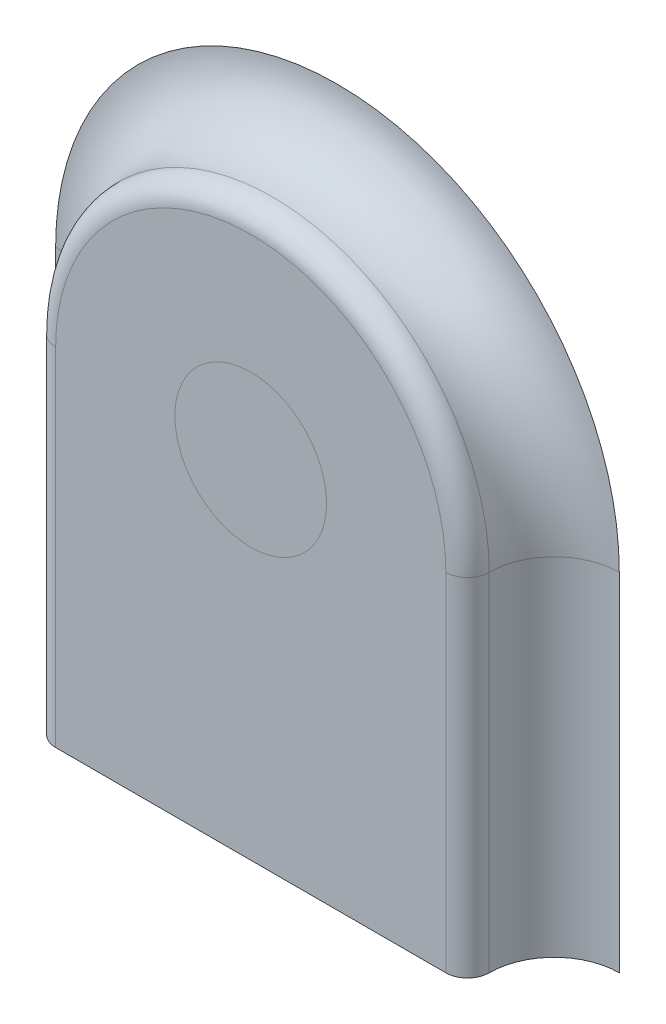
ISO-10303-21;
HEADER;
FILE_DESCRIPTION(('STEP AP214'),'2;1');
FILE_NAME('part.step','',(''),(''),'','','');
FILE_SCHEMA(('AUTOMOTIVE_DESIGN { 1 0 10303 214 1 1 1 1 }'));
ENDSEC;
DATA;
#1=APPLICATION_CONTEXT('core data for automotive mechanical design processes');
#2=APPLICATION_PROTOCOL_DEFINITION('international standard','automotive_design',2000,#1);
#3=PRODUCT_CONTEXT('',#1,'mechanical');
#4=PRODUCT('Part','Part','',(#3));
#5=PRODUCT_RELATED_PRODUCT_CATEGORY('part','',(#4));
#6=PRODUCT_DEFINITION_FORMATION('','',#4);
#7=PRODUCT_DEFINITION_CONTEXT('part definition',#1,'design');
#8=PRODUCT_DEFINITION('design','',#6,#7);
#9=PRODUCT_DEFINITION_SHAPE('','',#8);
#10=(LENGTH_UNIT() NAMED_UNIT(*) SI_UNIT(.MILLI.,.METRE.));
#11=(NAMED_UNIT(*) PLANE_ANGLE_UNIT() SI_UNIT($,.RADIAN.));
#12=(NAMED_UNIT(*) SI_UNIT($,.STERADIAN.) SOLID_ANGLE_UNIT());
#13=UNCERTAINTY_MEASURE_WITH_UNIT(LENGTH_MEASURE(1.E-05),#10,'distance_accuracy_value','');
#14=(GEOMETRIC_REPRESENTATION_CONTEXT(3) GLOBAL_UNCERTAINTY_ASSIGNED_CONTEXT((#13)) GLOBAL_UNIT_ASSIGNED_CONTEXT((#10,
#11,#12)) REPRESENTATION_CONTEXT('',''));
#15=CARTESIAN_POINT('',(0.,0.,0.));
#16=DIRECTION('',(0.,0.,1.));
#17=DIRECTION('',(1.,0.,0.));
#18=AXIS2_PLACEMENT_3D('',#15,#16,#17);
#19=CARTESIAN_POINT('',(0.,0.,2.));
#20=DIRECTION('',(0.,0.,1.));
#21=DIRECTION('',(1.,0.,0.));
#22=AXIS2_PLACEMENT_3D('',#19,#20,#21);
#23=PLANE('',#22);
#24=DIRECTION('',(1.,0.,0.));
#25=VECTOR('',#24,1.);
#26=CARTESIAN_POINT('',(-5.,-8.,2.));
#27=LINE('',#26,#25);
#28=CARTESIAN_POINT('',(-4.5,-8.,2.));
#29=VERTEX_POINT('',#28);
#30=CARTESIAN_POINT('',(4.5,-8.,2.));
#31=VERTEX_POINT('',#30);
#32=EDGE_CURVE('E112',#29,#31,#27,.T.);
#33=ORIENTED_EDGE('',*,*,#32,.T.);
#34=DIRECTION('',(0.,1.,0.));
#35=VECTOR('',#34,1.);
#36=CARTESIAN_POINT('',(4.5,0.,2.));
#37=LINE('',#36,#35);
#38=CARTESIAN_POINT('',(4.5,0.,2.));
#39=VERTEX_POINT('',#38);
#40=EDGE_CURVE('E133',#31,#39,#37,.T.);
#41=ORIENTED_EDGE('',*,*,#40,.T.);
#42=CARTESIAN_POINT('',(0.,0.,2.));
#43=DIRECTION('',(0.,0.,1.));
#44=DIRECTION('',(1.,0.,0.));
#45=AXIS2_PLACEMENT_3D('',#42,#43,#44);
#46=CIRCLE('',#45,4.5);
#47=CARTESIAN_POINT('',(-4.5,0.,2.));
#48=VERTEX_POINT('',#47);
#49=EDGE_CURVE('E54',#39,#48,#46,.T.);
#50=ORIENTED_EDGE('',*,*,#49,.T.);
#51=DIRECTION('',(0.,-1.,0.));
#52=VECTOR('',#51,1.);
#53=CARTESIAN_POINT('',(-4.5,-8.,2.));
#54=LINE('',#53,#52);
#55=EDGE_CURVE('E131',#48,#29,#54,.T.);
#56=ORIENTED_EDGE('',*,*,#55,.T.);
#57=EDGE_LOOP('',(#33,#41,#50,#56));
#58=FACE_BOUND('',#57,.T.);
#59=CARTESIAN_POINT('',(0.,0.,2.));
#60=DIRECTION('',(0.,0.,1.));
#61=DIRECTION('',(1.,0.,0.));
#62=AXIS2_PLACEMENT_3D('',#59,#60,#61);
#63=CIRCLE('',#62,1.75);
#64=CARTESIAN_POINT('',(1.75,0.,2.));
#65=VERTEX_POINT('',#64);
#66=EDGE_CURVE('E11',#65,#65,#63,.F.);
#67=ORIENTED_EDGE('',*,*,#66,.T.);
#68=EDGE_LOOP('',(#67));
#69=FACE_BOUND('',#68,.T.);
#70=ADVANCED_FACE('F38',(#58,#69),#23,.T.);
#71=CARTESIAN_POINT('',(-5.,-8.,2.));
#72=DIRECTION('',(0.,1.,0.));
#73=DIRECTION('',(0.,0.,1.));
#74=AXIS2_PLACEMENT_3D('',#71,#72,#73);
#75=PLANE('',#74);
#76=CARTESIAN_POINT('',(6.5,-8.,1.5));
#77=DIRECTION('',(0.,1.,0.));
#78=DIRECTION('',(0.,0.,1.));
#79=AXIS2_PLACEMENT_3D('',#76,#77,#78);
#80=CIRCLE('',#79,1.5);
#81=CARTESIAN_POINT('',(6.5,-8.,0.));
#82=VERTEX_POINT('',#81);
#83=CARTESIAN_POINT('',(5.,-8.,1.5));
#84=VERTEX_POINT('',#83);
#85=EDGE_CURVE('E107',#82,#84,#80,.T.);
#86=ORIENTED_EDGE('',*,*,#85,.T.);
#87=CARTESIAN_POINT('',(4.5,-8.,1.5));
#88=DIRECTION('',(0.,1.,0.));
#89=DIRECTION('',(0.,0.,1.));
#90=AXIS2_PLACEMENT_3D('',#87,#88,#89);
#91=CIRCLE('',#90,0.5);
#92=EDGE_CURVE('E47',#84,#31,#91,.F.);
#93=ORIENTED_EDGE('',*,*,#92,.T.);
#94=ORIENTED_EDGE('',*,*,#32,.F.);
#95=CARTESIAN_POINT('',(-4.5,-8.,1.5));
#96=DIRECTION('',(0.,1.,0.));
#97=DIRECTION('',(0.,0.,1.));
#98=AXIS2_PLACEMENT_3D('',#95,#96,#97);
#99=CIRCLE('',#98,0.5);
#100=CARTESIAN_POINT('',(-5.,-8.,1.5));
#101=VERTEX_POINT('',#100);
#102=EDGE_CURVE('E135',#29,#101,#99,.F.);
#103=ORIENTED_EDGE('',*,*,#102,.T.);
#104=CARTESIAN_POINT('',(-6.5,-8.,1.5));
#105=DIRECTION('',(0.,1.,0.));
#106=DIRECTION('',(0.,0.,1.));
#107=AXIS2_PLACEMENT_3D('',#104,#105,#106);
#108=CIRCLE('',#107,1.5);
#109=CARTESIAN_POINT('',(-6.5,-8.,0.));
#110=VERTEX_POINT('',#109);
#111=EDGE_CURVE('E110',#101,#110,#108,.T.);
#112=ORIENTED_EDGE('',*,*,#111,.T.);
#113=DIRECTION('',(1.,0.,0.));
#114=VECTOR('',#113,1.);
#115=CARTESIAN_POINT('',(-5.,-8.,0.));
#116=LINE('',#115,#114);
#117=EDGE_CURVE('E96',#110,#82,#116,.T.);
#118=ORIENTED_EDGE('',*,*,#117,.T.);
#119=EDGE_LOOP('',(#86,#93,#94,#103,#112,#118));
#120=FACE_BOUND('',#119,.T.);
#121=ADVANCED_FACE('F106',(#120),#75,.F.);
#122=ORIENTED_EDGE('',*,*,#66,.F.);
#123=EDGE_LOOP('',(#122));
#124=FACE_BOUND('',#123,.T.);
#125=ADVANCED_FACE('F170',(#124),#23,.T.);
#126=CARTESIAN_POINT('',(-6.5,0.,1.5));
#127=DIRECTION('',(0.,1.,0.));
#128=DIRECTION('',(-1.,0.,0.));
#129=AXIS2_PLACEMENT_3D('',#126,#127,#128);
#130=CYLINDRICAL_SURFACE('',#129,1.5);
#131=ORIENTED_EDGE('',*,*,#111,.F.);
#132=DIRECTION('',(0.,-1.,0.));
#133=VECTOR('',#132,1.);
#134=CARTESIAN_POINT('',(-5.,-8.,1.5));
#135=LINE('',#134,#133);
#136=CARTESIAN_POINT('',(-5.,0.,1.5));
#137=VERTEX_POINT('',#136);
#138=EDGE_CURVE('E118',#137,#101,#135,.T.);
#139=ORIENTED_EDGE('',*,*,#138,.F.);
#140=CARTESIAN_POINT('',(-6.5,0.,1.5));
#141=DIRECTION('',(0.,-1.,0.));
#142=DIRECTION('',(0.,0.,-1.));
#143=AXIS2_PLACEMENT_3D('',#140,#141,#142);
#144=CIRCLE('',#143,1.5);
#145=CARTESIAN_POINT('',(-6.5,0.,0.));
#146=VERTEX_POINT('',#145);
#147=EDGE_CURVE('E113',#146,#137,#144,.T.);
#148=ORIENTED_EDGE('',*,*,#147,.F.);
#149=DIRECTION('',(0.,-1.,0.));
#150=VECTOR('',#149,1.);
#151=CARTESIAN_POINT('',(-6.5,0.,0.));
#152=LINE('',#151,#150);
#153=EDGE_CURVE('E150',#110,#146,#152,.F.);
#154=ORIENTED_EDGE('',*,*,#153,.F.);
#155=EDGE_LOOP('',(#131,#139,#148,#154));
#156=FACE_BOUND('',#155,.T.);
#157=ADVANCED_FACE('F156',(#156),#130,.F.);
#158=CARTESIAN_POINT('',(0.,0.,1.5));
#159=DIRECTION('',(0.,0.,-1.));
#160=DIRECTION('',(-1.,0.,0.));
#161=AXIS2_PLACEMENT_3D('',#158,#159,#160);
#162=TOROIDAL_SURFACE('',#161,6.5,1.5);
#163=ORIENTED_EDGE('',*,*,#147,.T.);
#164=CARTESIAN_POINT('',(0.,0.,1.5));
#165=DIRECTION('',(0.,0.,-1.));
#166=DIRECTION('',(-1.,0.,0.));
#167=AXIS2_PLACEMENT_3D('',#164,#165,#166);
#168=CIRCLE('',#167,5.);
#169=CARTESIAN_POINT('',(5.,0.,1.5));
#170=VERTEX_POINT('',#169);
#171=EDGE_CURVE('E103',#170,#137,#168,.F.);
#172=ORIENTED_EDGE('',*,*,#171,.F.);
#173=CARTESIAN_POINT('',(6.5,0.,1.5));
#174=DIRECTION('',(0.,1.,0.));
#175=DIRECTION('',(-1.,0.,0.));
#176=AXIS2_PLACEMENT_3D('',#173,#174,#175);
#177=CIRCLE('',#176,1.5);
#178=CARTESIAN_POINT('',(6.5,0.,0.));
#179=VERTEX_POINT('',#178);
#180=EDGE_CURVE('E125',#179,#170,#177,.T.);
#181=ORIENTED_EDGE('',*,*,#180,.F.);
#182=CARTESIAN_POINT('',(0.,0.,0.));
#183=DIRECTION('',(0.,0.,-1.));
#184=DIRECTION('',(-1.,0.,0.));
#185=AXIS2_PLACEMENT_3D('',#182,#183,#184);
#186=CIRCLE('',#185,6.5);
#187=EDGE_CURVE('E99',#146,#179,#186,.T.);
#188=ORIENTED_EDGE('',*,*,#187,.F.);
#189=EDGE_LOOP('',(#163,#172,#181,#188));
#190=FACE_BOUND('',#189,.T.);
#191=ADVANCED_FACE('F158',(#190),#162,.F.);
#192=CARTESIAN_POINT('',(6.5,0.,1.5));
#193=DIRECTION('',(0.,-1.,0.));
#194=DIRECTION('',(1.,0.,0.));
#195=AXIS2_PLACEMENT_3D('',#192,#193,#194);
#196=CYLINDRICAL_SURFACE('',#195,1.5);
#197=ORIENTED_EDGE('',*,*,#85,.F.);
#198=DIRECTION('',(0.,1.,0.));
#199=VECTOR('',#198,1.);
#200=CARTESIAN_POINT('',(6.5,-8.,0.));
#201=LINE('',#200,#199);
#202=EDGE_CURVE('E93',#179,#82,#201,.F.);
#203=ORIENTED_EDGE('',*,*,#202,.F.);
#204=ORIENTED_EDGE('',*,*,#180,.T.);
#205=DIRECTION('',(0.,1.,0.));
#206=VECTOR('',#205,1.);
#207=CARTESIAN_POINT('',(5.,0.,1.5));
#208=LINE('',#207,#206);
#209=EDGE_CURVE('E116',#84,#170,#208,.T.);
#210=ORIENTED_EDGE('',*,*,#209,.F.);
#211=EDGE_LOOP('',(#197,#203,#204,#210));
#212=FACE_BOUND('',#211,.T.);
#213=ADVANCED_FACE('F115',(#212),#196,.F.);
#214=CARTESIAN_POINT('',(-4.5,0.,1.5));
#215=DIRECTION('',(0.,1.,0.));
#216=DIRECTION('',(-1.,0.,0.));
#217=AXIS2_PLACEMENT_3D('',#214,#215,#216);
#218=CYLINDRICAL_SURFACE('',#217,0.5);
#219=ORIENTED_EDGE('',*,*,#102,.F.);
#220=ORIENTED_EDGE('',*,*,#55,.F.);
#221=CARTESIAN_POINT('',(-4.5,0.,1.5));
#222=DIRECTION('',(0.,1.,0.));
#223=DIRECTION('',(-1.,0.,0.));
#224=AXIS2_PLACEMENT_3D('',#221,#222,#223);
#225=CIRCLE('',#224,0.5);
#226=EDGE_CURVE('E127',#137,#48,#225,.T.);
#227=ORIENTED_EDGE('',*,*,#226,.F.);
#228=ORIENTED_EDGE('',*,*,#138,.T.);
#229=EDGE_LOOP('',(#219,#220,#227,#228));
#230=FACE_BOUND('',#229,.T.);
#231=ADVANCED_FACE('F40',(#230),#218,.T.);
#232=CARTESIAN_POINT('',(0.,0.,1.5));
#233=DIRECTION('',(0.,0.,1.));
#234=DIRECTION('',(1.,0.,0.));
#235=AXIS2_PLACEMENT_3D('',#232,#233,#234);
#236=TOROIDAL_SURFACE('',#235,4.5,0.5);
#237=ORIENTED_EDGE('',*,*,#226,.T.);
#238=ORIENTED_EDGE('',*,*,#49,.F.);
#239=CARTESIAN_POINT('',(4.5,0.,1.5));
#240=DIRECTION('',(0.,-1.,0.));
#241=DIRECTION('',(1.,0.,0.));
#242=AXIS2_PLACEMENT_3D('',#239,#240,#241);
#243=CIRCLE('',#242,0.5);
#244=EDGE_CURVE('E62',#170,#39,#243,.T.);
#245=ORIENTED_EDGE('',*,*,#244,.F.);
#246=ORIENTED_EDGE('',*,*,#171,.T.);
#247=EDGE_LOOP('',(#237,#238,#245,#246));
#248=FACE_BOUND('',#247,.T.);
#249=ADVANCED_FACE('F142',(#248),#236,.T.);
#250=CARTESIAN_POINT('',(4.5,0.,1.5));
#251=DIRECTION('',(0.,-1.,0.));
#252=DIRECTION('',(1.,0.,0.));
#253=AXIS2_PLACEMENT_3D('',#250,#251,#252);
#254=CYLINDRICAL_SURFACE('',#253,0.5);
#255=ORIENTED_EDGE('',*,*,#92,.F.);
#256=ORIENTED_EDGE('',*,*,#209,.T.);
#257=ORIENTED_EDGE('',*,*,#244,.T.);
#258=ORIENTED_EDGE('',*,*,#40,.F.);
#259=EDGE_LOOP('',(#255,#256,#257,#258));
#260=FACE_BOUND('',#259,.T.);
#261=ADVANCED_FACE('F159',(#260),#254,.T.);
#262=CARTESIAN_POINT('',(9.5,-10.,0.));
#263=DIRECTION('',(0.,0.,1.));
#264=DIRECTION('',(1.,0.,0.));
#265=AXIS2_PLACEMENT_3D('',#262,#263,#264);
#266=PLANE('',#265);
#267=ORIENTED_EDGE('',*,*,#153,.T.);
#268=ORIENTED_EDGE('',*,*,#187,.T.);
#269=ORIENTED_EDGE('',*,*,#202,.T.);
#270=ORIENTED_EDGE('',*,*,#117,.F.);
#271=EDGE_LOOP('',(#267,#268,#269,#270));
#272=FACE_BOUND('',#271,.T.);
#273=ADVANCED_FACE('F95',(#272),#266,.F.);
#274=CLOSED_SHELL('',(#70,#121,#125,#157,#191,#213,#231,#249,#261,#273));
#275=MANIFOLD_SOLID_BREP('B2',#274);
#276=ADVANCED_BREP_SHAPE_REPRESENTATION('',(#18,#275),#14);
#277=SHAPE_DEFINITION_REPRESENTATION(#9,#276);
ENDSEC;
END-ISO-10303-21;
